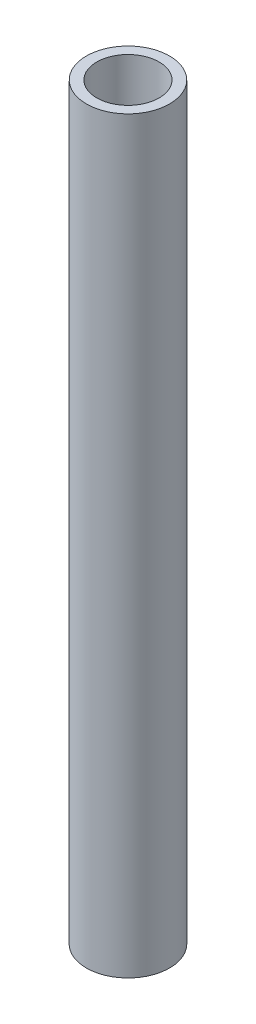
ISO-10303-21;
HEADER;
FILE_DESCRIPTION(('STEP AP214'),'2;1');
FILE_NAME('part.step','',(''),(''),'','','');
FILE_SCHEMA(('AUTOMOTIVE_DESIGN { 1 0 10303 214 1 1 1 1 }'));
ENDSEC;
DATA;
#1=APPLICATION_CONTEXT('core data for automotive mechanical design processes');
#2=APPLICATION_PROTOCOL_DEFINITION('international standard','automotive_design',2000,#1);
#3=PRODUCT_CONTEXT('',#1,'mechanical');
#4=PRODUCT('Part','Part','',(#3));
#5=PRODUCT_RELATED_PRODUCT_CATEGORY('part','',(#4));
#6=PRODUCT_DEFINITION_FORMATION('','',#4);
#7=PRODUCT_DEFINITION_CONTEXT('part definition',#1,'design');
#8=PRODUCT_DEFINITION('design','',#6,#7);
#9=PRODUCT_DEFINITION_SHAPE('','',#8);
#10=(LENGTH_UNIT() NAMED_UNIT(*) SI_UNIT(.MILLI.,.METRE.));
#11=(NAMED_UNIT(*) PLANE_ANGLE_UNIT() SI_UNIT($,.RADIAN.));
#12=(NAMED_UNIT(*) SI_UNIT($,.STERADIAN.) SOLID_ANGLE_UNIT());
#13=UNCERTAINTY_MEASURE_WITH_UNIT(LENGTH_MEASURE(1.E-05),#10,'distance_accuracy_value','');
#14=(GEOMETRIC_REPRESENTATION_CONTEXT(3) GLOBAL_UNCERTAINTY_ASSIGNED_CONTEXT((#13)) GLOBAL_UNIT_ASSIGNED_CONTEXT((#10,
#11,#12)) REPRESENTATION_CONTEXT('',''));
#15=CARTESIAN_POINT('',(0.,0.,0.));
#16=DIRECTION('',(0.,0.,1.));
#17=DIRECTION('',(1.,0.,0.));
#18=AXIS2_PLACEMENT_3D('',#15,#16,#17);
#19=CARTESIAN_POINT('',(-391.18166808322,228.6,-212.743279788072));
#20=DIRECTION('',(0.,1.,0.));
#21=DIRECTION('',(0.,0.,1.));
#22=AXIS2_PLACEMENT_3D('',#19,#20,#21);
#23=PLANE('',#22);
#24=CARTESIAN_POINT('',(-391.18166808322,228.6,-212.743279788072));
#25=DIRECTION('',(0.,1.,0.));
#26=DIRECTION('',(0.,0.,1.));
#27=AXIS2_PLACEMENT_3D('',#24,#25,#26);
#28=CIRCLE('',#27,12.7);
#29=CARTESIAN_POINT('',(-391.18166808322,228.6,-200.043279788072));
#30=VERTEX_POINT('',#29);
#31=EDGE_CURVE('E10',#30,#30,#28,.T.);
#32=ORIENTED_EDGE('',*,*,#31,.T.);
#33=EDGE_LOOP('',(#32));
#34=FACE_BOUND('',#33,.T.);
#35=CARTESIAN_POINT('',(-391.18166808322,228.6,-212.743279788072));
#36=DIRECTION('',(0.,1.,0.));
#37=DIRECTION('',(0.,0.,1.));
#38=AXIS2_PLACEMENT_3D('',#35,#36,#37);
#39=CIRCLE('',#38,9.52500000000002);
#40=CARTESIAN_POINT('',(-391.18166808322,228.6,-203.218279788071));
#41=VERTEX_POINT('',#40);
#42=EDGE_CURVE('E42',#41,#41,#39,.T.);
#43=ORIENTED_EDGE('',*,*,#42,.F.);
#44=EDGE_LOOP('',(#43));
#45=FACE_BOUND('',#44,.T.);
#46=ADVANCED_FACE('F31',(#34,#45),#23,.T.);
#47=CARTESIAN_POINT('',(-391.18166808322,0.,-212.743279788072));
#48=DIRECTION('',(0.,1.,0.));
#49=DIRECTION('',(0.,0.,1.));
#50=AXIS2_PLACEMENT_3D('',#47,#48,#49);
#51=PLANE('',#50);
#52=CARTESIAN_POINT('',(-391.18166808322,0.,-212.743279788072));
#53=DIRECTION('',(0.,1.,0.));
#54=DIRECTION('',(0.,0.,1.));
#55=AXIS2_PLACEMENT_3D('',#52,#53,#54);
#56=CIRCLE('',#55,12.7);
#57=CARTESIAN_POINT('',(-391.18166808322,0.,-200.043279788072));
#58=VERTEX_POINT('',#57);
#59=EDGE_CURVE('E35',#58,#58,#56,.T.);
#60=ORIENTED_EDGE('',*,*,#59,.F.);
#61=EDGE_LOOP('',(#60));
#62=FACE_BOUND('',#61,.T.);
#63=CARTESIAN_POINT('',(-391.18166808322,0.,-212.743279788072));
#64=DIRECTION('',(0.,1.,0.));
#65=DIRECTION('',(0.,0.,1.));
#66=AXIS2_PLACEMENT_3D('',#63,#64,#65);
#67=CIRCLE('',#66,9.52500000000002);
#68=CARTESIAN_POINT('',(-391.18166808322,0.,-203.218279788071));
#69=VERTEX_POINT('',#68);
#70=EDGE_CURVE('E44',#69,#69,#67,.T.);
#71=ORIENTED_EDGE('',*,*,#70,.T.);
#72=EDGE_LOOP('',(#71));
#73=FACE_BOUND('',#72,.T.);
#74=ADVANCED_FACE('F54',(#62,#73),#51,.F.);
#75=CARTESIAN_POINT('',(-391.18166808322,228.6,-212.743279788072));
#76=DIRECTION('',(0.,-1.,0.));
#77=DIRECTION('',(0.,0.,-1.));
#78=AXIS2_PLACEMENT_3D('',#75,#76,#77);
#79=CYLINDRICAL_SURFACE('',#78,12.7);
#80=ORIENTED_EDGE('',*,*,#31,.F.);
#81=EDGE_LOOP('',(#80));
#82=FACE_BOUND('',#81,.T.);
#83=ORIENTED_EDGE('',*,*,#59,.T.);
#84=EDGE_LOOP('',(#83));
#85=FACE_BOUND('',#84,.T.);
#86=ADVANCED_FACE('F33',(#82,#85),#79,.T.);
#87=CARTESIAN_POINT('',(-391.18166808322,228.6,-212.743279788072));
#88=DIRECTION('',(0.,-1.,0.));
#89=DIRECTION('',(0.,0.,-1.));
#90=AXIS2_PLACEMENT_3D('',#87,#88,#89);
#91=CYLINDRICAL_SURFACE('',#90,9.52500000000002);
#92=ORIENTED_EDGE('',*,*,#42,.T.);
#93=EDGE_LOOP('',(#92));
#94=FACE_BOUND('',#93,.T.);
#95=ORIENTED_EDGE('',*,*,#70,.F.);
#96=EDGE_LOOP('',(#95));
#97=FACE_BOUND('',#96,.T.);
#98=ADVANCED_FACE('F50',(#94,#97),#91,.F.);
#99=CLOSED_SHELL('',(#46,#74,#86,#98));
#100=MANIFOLD_SOLID_BREP('B2',#99);
#101=ADVANCED_BREP_SHAPE_REPRESENTATION('',(#18,#100),#14);
#102=SHAPE_DEFINITION_REPRESENTATION(#9,#101);
ENDSEC;
END-ISO-10303-21;
